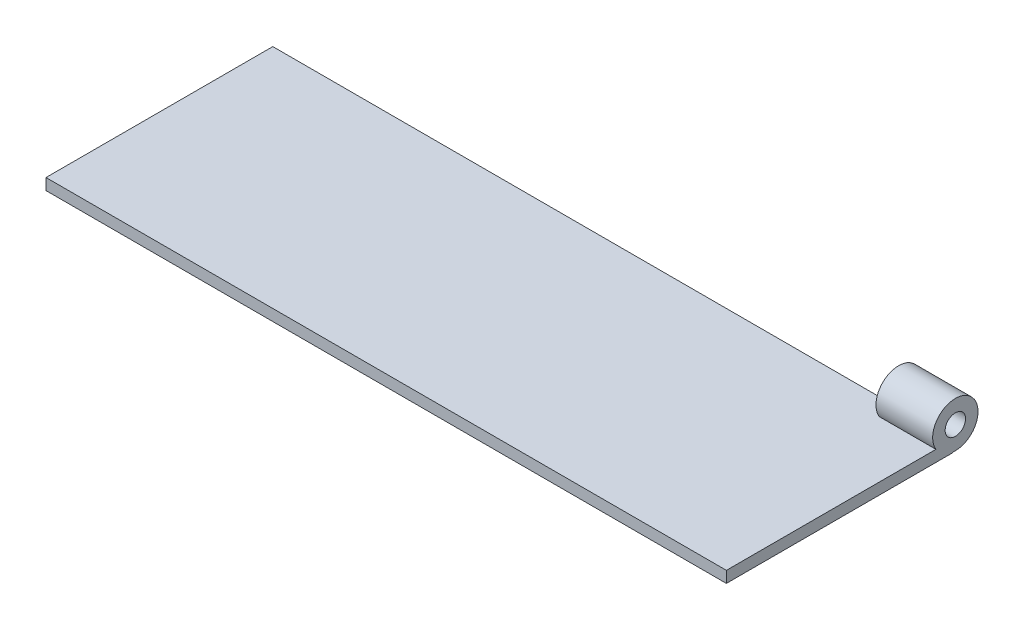
ISO-10303-21;
HEADER;
FILE_DESCRIPTION(('STEP AP214'),'2;1');
FILE_NAME('part.step','',(''),(''),'','','');
FILE_SCHEMA(('AUTOMOTIVE_DESIGN { 1 0 10303 214 1 1 1 1 }'));
ENDSEC;
DATA;
#1=APPLICATION_CONTEXT('core data for automotive mechanical design processes');
#2=APPLICATION_PROTOCOL_DEFINITION('international standard','automotive_design',2000,#1);
#3=PRODUCT_CONTEXT('',#1,'mechanical');
#4=PRODUCT('Part','Part','',(#3));
#5=PRODUCT_RELATED_PRODUCT_CATEGORY('part','',(#4));
#6=PRODUCT_DEFINITION_FORMATION('','',#4);
#7=PRODUCT_DEFINITION_CONTEXT('part definition',#1,'design');
#8=PRODUCT_DEFINITION('design','',#6,#7);
#9=PRODUCT_DEFINITION_SHAPE('','',#8);
#10=(LENGTH_UNIT() NAMED_UNIT(*) SI_UNIT(.MILLI.,.METRE.));
#11=(NAMED_UNIT(*) PLANE_ANGLE_UNIT() SI_UNIT($,.RADIAN.));
#12=(NAMED_UNIT(*) SI_UNIT($,.STERADIAN.) SOLID_ANGLE_UNIT());
#13=UNCERTAINTY_MEASURE_WITH_UNIT(LENGTH_MEASURE(1.E-05),#10,'distance_accuracy_value','');
#14=(GEOMETRIC_REPRESENTATION_CONTEXT(3) GLOBAL_UNCERTAINTY_ASSIGNED_CONTEXT((#13)) GLOBAL_UNIT_ASSIGNED_CONTEXT((#10,
#11,#12)) REPRESENTATION_CONTEXT('',''));
#15=CARTESIAN_POINT('',(0.,0.,0.));
#16=DIRECTION('',(0.,0.,1.));
#17=DIRECTION('',(1.,0.,0.));
#18=AXIS2_PLACEMENT_3D('',#15,#16,#17);
#19=CARTESIAN_POINT('',(-150.,5.,-50.));
#20=DIRECTION('',(1.,0.,0.));
#21=DIRECTION('',(0.,0.,-1.));
#22=AXIS2_PLACEMENT_3D('',#19,#20,#21);
#23=PLANE('',#22);
#24=DIRECTION('',(0.,0.,1.));
#25=VECTOR('',#24,1.);
#26=CARTESIAN_POINT('',(-150.,0.,-50.));
#27=LINE('',#26,#25);
#28=CARTESIAN_POINT('',(-150.,0.,-50.));
#29=VERTEX_POINT('',#28);
#30=CARTESIAN_POINT('',(-150.,0.,50.));
#31=VERTEX_POINT('',#30);
#32=EDGE_CURVE('E108',#29,#31,#27,.T.);
#33=ORIENTED_EDGE('',*,*,#32,.T.);
#34=DIRECTION('',(0.,-1.,0.));
#35=VECTOR('',#34,1.);
#36=CARTESIAN_POINT('',(-150.,5.,50.));
#37=LINE('',#36,#35);
#38=CARTESIAN_POINT('',(-150.,5.,50.));
#39=VERTEX_POINT('',#38);
#40=EDGE_CURVE('E90',#39,#31,#37,.T.);
#41=ORIENTED_EDGE('',*,*,#40,.F.);
#42=DIRECTION('',(0.,0.,1.));
#43=VECTOR('',#42,1.);
#44=CARTESIAN_POINT('',(-150.,5.,-50.));
#45=LINE('',#44,#43);
#46=CARTESIAN_POINT('',(-150.,5.,-50.));
#47=VERTEX_POINT('',#46);
#48=EDGE_CURVE('E97',#47,#39,#45,.T.);
#49=ORIENTED_EDGE('',*,*,#48,.F.);
#50=DIRECTION('',(0.,-1.,0.));
#51=VECTOR('',#50,1.);
#52=CARTESIAN_POINT('',(-150.,5.,-50.));
#53=LINE('',#52,#51);
#54=EDGE_CURVE('E115',#47,#29,#53,.T.);
#55=ORIENTED_EDGE('',*,*,#54,.T.);
#56=EDGE_LOOP('',(#33,#41,#49,#55));
#57=FACE_BOUND('',#56,.T.);
#58=ADVANCED_FACE('F36',(#57),#23,.F.);
#59=CARTESIAN_POINT('',(150.,5.,50.));
#60=DIRECTION('',(0.,0.,-1.));
#61=DIRECTION('',(-1.,0.,0.));
#62=AXIS2_PLACEMENT_3D('',#59,#60,#61);
#63=PLANE('',#62);
#64=DIRECTION('',(1.,0.,0.));
#65=VECTOR('',#64,1.);
#66=CARTESIAN_POINT('',(150.,0.,50.));
#67=LINE('',#66,#65);
#68=CARTESIAN_POINT('',(150.,0.,50.));
#69=VERTEX_POINT('',#68);
#70=EDGE_CURVE('E121',#31,#69,#67,.T.);
#71=ORIENTED_EDGE('',*,*,#70,.T.);
#72=DIRECTION('',(0.,-1.,0.));
#73=VECTOR('',#72,1.);
#74=CARTESIAN_POINT('',(150.,5.,50.));
#75=LINE('',#74,#73);
#76=CARTESIAN_POINT('',(150.,5.,50.));
#77=VERTEX_POINT('',#76);
#78=EDGE_CURVE('E93',#77,#69,#75,.T.);
#79=ORIENTED_EDGE('',*,*,#78,.F.);
#80=DIRECTION('',(1.,0.,0.));
#81=VECTOR('',#80,1.);
#82=CARTESIAN_POINT('',(150.,5.,50.));
#83=LINE('',#82,#81);
#84=EDGE_CURVE('E86',#39,#77,#83,.T.);
#85=ORIENTED_EDGE('',*,*,#84,.F.);
#86=ORIENTED_EDGE('',*,*,#40,.T.);
#87=EDGE_LOOP('',(#71,#79,#85,#86));
#88=FACE_BOUND('',#87,.T.);
#89=ADVANCED_FACE('F88',(#88),#63,.F.);
#90=CARTESIAN_POINT('',(150.,5.,-50.));
#91=DIRECTION('',(-1.,0.,0.));
#92=DIRECTION('',(0.,0.,1.));
#93=AXIS2_PLACEMENT_3D('',#90,#91,#92);
#94=PLANE('',#93);
#95=CARTESIAN_POINT('',(150.,10.172311348783,-50.9541547185409));
#96=DIRECTION('',(1.,0.,0.));
#97=DIRECTION('',(0.,0.,-1.));
#98=AXIS2_PLACEMENT_3D('',#95,#96,#97);
#99=CIRCLE('',#98,4.5);
#100=CARTESIAN_POINT('',(150.,10.172311348783,-55.4541547185409));
#101=VERTEX_POINT('',#100);
#102=EDGE_CURVE('E135',#101,#101,#99,.T.);
#103=ORIENTED_EDGE('',*,*,#102,.F.);
#104=EDGE_LOOP('',(#103));
#105=FACE_BOUND('',#104,.T.);
#106=DIRECTION('',(0.,-1.,0.));
#107=VECTOR('',#106,1.);
#108=CARTESIAN_POINT('',(150.,5.,-50.));
#109=LINE('',#108,#107);
#110=CARTESIAN_POINT('',(150.,0.217935990525383,-50.));
#111=VERTEX_POINT('',#110);
#112=CARTESIAN_POINT('',(150.,0.,-50.));
#113=VERTEX_POINT('',#112);
#114=EDGE_CURVE('E111',#111,#113,#109,.T.);
#115=ORIENTED_EDGE('',*,*,#114,.F.);
#116=CARTESIAN_POINT('',(150.,10.172311348783,-50.9541547185409));
#117=DIRECTION('',(1.,0.,0.));
#118=DIRECTION('',(0.,0.,-1.));
#119=AXIS2_PLACEMENT_3D('',#116,#117,#118);
#120=CIRCLE('',#119,10.);
#121=CARTESIAN_POINT('',(150.,5.,-42.3956971874638));
#122=VERTEX_POINT('',#121);
#123=EDGE_CURVE('E129',#111,#122,#120,.T.);
#124=ORIENTED_EDGE('',*,*,#123,.T.);
#125=DIRECTION('',(0.,0.,-1.));
#126=VECTOR('',#125,1.);
#127=CARTESIAN_POINT('',(150.,5.,-50.));
#128=LINE('',#127,#126);
#129=EDGE_CURVE('E96',#77,#122,#128,.T.);
#130=ORIENTED_EDGE('',*,*,#129,.F.);
#131=ORIENTED_EDGE('',*,*,#78,.T.);
#132=DIRECTION('',(0.,0.,-1.));
#133=VECTOR('',#132,1.);
#134=CARTESIAN_POINT('',(150.,0.,-50.));
#135=LINE('',#134,#133);
#136=EDGE_CURVE('E118',#69,#113,#135,.T.);
#137=ORIENTED_EDGE('',*,*,#136,.T.);
#138=EDGE_LOOP('',(#115,#124,#130,#131,#137));
#139=FACE_BOUND('',#138,.T.);
#140=ADVANCED_FACE('F150',(#105,#139),#94,.F.);
#141=CARTESIAN_POINT('',(150.,5.,-50.));
#142=DIRECTION('',(0.,0.,1.));
#143=DIRECTION('',(1.,0.,0.));
#144=AXIS2_PLACEMENT_3D('',#141,#142,#143);
#145=PLANE('',#144);
#146=DIRECTION('',(0.,1.,0.));
#147=VECTOR('',#146,1.);
#148=CARTESIAN_POINT('',(125.,5.,-50.));
#149=LINE('',#148,#147);
#150=CARTESIAN_POINT('',(125.,0.217935990525383,-50.));
#151=VERTEX_POINT('',#150);
#152=CARTESIAN_POINT('',(125.,5.,-50.));
#153=VERTEX_POINT('',#152);
#154=EDGE_CURVE('E50',#151,#153,#149,.T.);
#155=ORIENTED_EDGE('',*,*,#154,.F.);
#156=DIRECTION('',(1.,0.,0.));
#157=VECTOR('',#156,1.);
#158=CARTESIAN_POINT('',(125.,0.217935990525383,-50.));
#159=LINE('',#158,#157);
#160=EDGE_CURVE('E54',#151,#111,#159,.T.);
#161=ORIENTED_EDGE('',*,*,#160,.T.);
#162=ORIENTED_EDGE('',*,*,#114,.T.);
#163=DIRECTION('',(-1.,0.,0.));
#164=VECTOR('',#163,1.);
#165=CARTESIAN_POINT('',(150.,0.,-50.));
#166=LINE('',#165,#164);
#167=EDGE_CURVE('E105',#113,#29,#166,.T.);
#168=ORIENTED_EDGE('',*,*,#167,.T.);
#169=ORIENTED_EDGE('',*,*,#54,.F.);
#170=DIRECTION('',(-1.,0.,0.));
#171=VECTOR('',#170,1.);
#172=CARTESIAN_POINT('',(150.,5.,-50.));
#173=LINE('',#172,#171);
#174=EDGE_CURVE('E101',#153,#47,#173,.T.);
#175=ORIENTED_EDGE('',*,*,#174,.F.);
#176=EDGE_LOOP('',(#155,#161,#162,#168,#169,#175));
#177=FACE_BOUND('',#176,.T.);
#178=ADVANCED_FACE('F153',(#177),#145,.F.);
#179=CARTESIAN_POINT('',(0.,5.,0.));
#180=DIRECTION('',(0.,-1.,0.));
#181=DIRECTION('',(0.,0.,-1.));
#182=AXIS2_PLACEMENT_3D('',#179,#180,#181);
#183=PLANE('',#182);
#184=ORIENTED_EDGE('',*,*,#129,.T.);
#185=DIRECTION('',(1.,0.,0.));
#186=VECTOR('',#185,1.);
#187=CARTESIAN_POINT('',(125.,5.,-42.3956971874638));
#188=LINE('',#187,#186);
#189=CARTESIAN_POINT('',(125.,5.,-42.3956971874638));
#190=VERTEX_POINT('',#189);
#191=EDGE_CURVE('E11',#122,#190,#188,.F.);
#192=ORIENTED_EDGE('',*,*,#191,.T.);
#193=DIRECTION('',(0.,0.,1.));
#194=VECTOR('',#193,1.);
#195=CARTESIAN_POINT('',(125.,5.,0.));
#196=LINE('',#195,#194);
#197=EDGE_CURVE('E43',#153,#190,#196,.T.);
#198=ORIENTED_EDGE('',*,*,#197,.F.);
#199=ORIENTED_EDGE('',*,*,#174,.T.);
#200=ORIENTED_EDGE('',*,*,#48,.T.);
#201=ORIENTED_EDGE('',*,*,#84,.T.);
#202=EDGE_LOOP('',(#184,#192,#198,#199,#200,#201));
#203=FACE_BOUND('',#202,.T.);
#204=ADVANCED_FACE('F100',(#203),#183,.F.);
#205=CARTESIAN_POINT('',(0.,0.,0.));
#206=DIRECTION('',(0.,-1.,0.));
#207=DIRECTION('',(0.,0.,-1.));
#208=AXIS2_PLACEMENT_3D('',#205,#206,#207);
#209=PLANE('',#208);
#210=ORIENTED_EDGE('',*,*,#32,.F.);
#211=ORIENTED_EDGE('',*,*,#167,.F.);
#212=ORIENTED_EDGE('',*,*,#136,.F.);
#213=ORIENTED_EDGE('',*,*,#70,.F.);
#214=EDGE_LOOP('',(#210,#211,#212,#213));
#215=FACE_BOUND('',#214,.T.);
#216=ADVANCED_FACE('F167',(#215),#209,.T.);
#217=CARTESIAN_POINT('',(125.,10.172311348783,-50.9541547185409));
#218=DIRECTION('',(1.,0.,0.));
#219=DIRECTION('',(0.,0.,-1.));
#220=AXIS2_PLACEMENT_3D('',#217,#218,#219);
#221=CYLINDRICAL_SURFACE('',#220,10.);
#222=ORIENTED_EDGE('',*,*,#160,.F.);
#223=CARTESIAN_POINT('',(125.,10.172311348783,-50.9541547185409));
#224=DIRECTION('',(1.,0.,0.));
#225=DIRECTION('',(0.,0.,-1.));
#226=AXIS2_PLACEMENT_3D('',#223,#224,#225);
#227=CIRCLE('',#226,10.);
#228=EDGE_CURVE('E128',#151,#190,#227,.T.);
#229=ORIENTED_EDGE('',*,*,#228,.T.);
#230=ORIENTED_EDGE('',*,*,#191,.F.);
#231=ORIENTED_EDGE('',*,*,#123,.F.);
#232=EDGE_LOOP('',(#222,#229,#230,#231));
#233=FACE_BOUND('',#232,.T.);
#234=ADVANCED_FACE('F160',(#233),#221,.T.);
#235=CARTESIAN_POINT('',(125.,10.172311348783,-50.9541547185409));
#236=DIRECTION('',(1.,0.,0.));
#237=DIRECTION('',(0.,0.,-1.));
#238=AXIS2_PLACEMENT_3D('',#235,#236,#237);
#239=PLANE('',#238);
#240=CARTESIAN_POINT('',(125.,10.172311348783,-50.9541547185409));
#241=DIRECTION('',(1.,0.,0.));
#242=DIRECTION('',(0.,0.,-1.));
#243=AXIS2_PLACEMENT_3D('',#240,#241,#242);
#244=CIRCLE('',#243,4.5);
#245=CARTESIAN_POINT('',(125.,10.172311348783,-55.4541547185409));
#246=VERTEX_POINT('',#245);
#247=EDGE_CURVE('E132',#246,#246,#244,.T.);
#248=ORIENTED_EDGE('',*,*,#247,.T.);
#249=EDGE_LOOP('',(#248));
#250=FACE_BOUND('',#249,.T.);
#251=ORIENTED_EDGE('',*,*,#228,.F.);
#252=ORIENTED_EDGE('',*,*,#154,.T.);
#253=ORIENTED_EDGE('',*,*,#197,.T.);
#254=EDGE_LOOP('',(#251,#252,#253));
#255=FACE_BOUND('',#254,.T.);
#256=ADVANCED_FACE('F141',(#250,#255),#239,.F.);
#257=CARTESIAN_POINT('',(125.,10.172311348783,-50.9541547185409));
#258=DIRECTION('',(1.,0.,0.));
#259=DIRECTION('',(0.,0.,-1.));
#260=AXIS2_PLACEMENT_3D('',#257,#258,#259);
#261=CYLINDRICAL_SURFACE('',#260,4.5);
#262=ORIENTED_EDGE('',*,*,#247,.F.);
#263=EDGE_LOOP('',(#262));
#264=FACE_BOUND('',#263,.T.);
#265=ORIENTED_EDGE('',*,*,#102,.T.);
#266=EDGE_LOOP('',(#265));
#267=FACE_BOUND('',#266,.T.);
#268=ADVANCED_FACE('F144',(#264,#267),#261,.F.);
#269=CLOSED_SHELL('',(#58,#89,#140,#178,#204,#216,#234,#256,#268));
#270=MANIFOLD_SOLID_BREP('B2',#269);
#271=ADVANCED_BREP_SHAPE_REPRESENTATION('',(#18,#270),#14);
#272=SHAPE_DEFINITION_REPRESENTATION(#9,#271);
ENDSEC;
END-ISO-10303-21;
